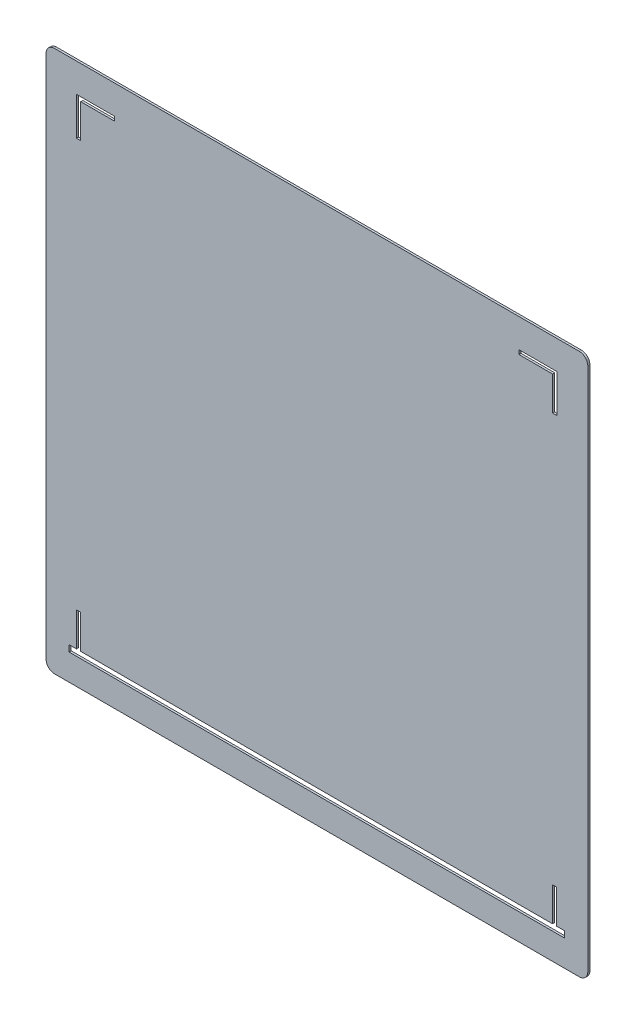
ISO-10303-21;
HEADER;
FILE_DESCRIPTION(('STEP AP214'),'2;1');
FILE_NAME('part.step','',(''),(''),'','','');
FILE_SCHEMA(('AUTOMOTIVE_DESIGN { 1 0 10303 214 1 1 1 1 }'));
ENDSEC;
DATA;
#1=APPLICATION_CONTEXT('core data for automotive mechanical design processes');
#2=APPLICATION_PROTOCOL_DEFINITION('international standard','automotive_design',2000,#1);
#3=PRODUCT_CONTEXT('',#1,'mechanical');
#4=PRODUCT('Part','Part','',(#3));
#5=PRODUCT_RELATED_PRODUCT_CATEGORY('part','',(#4));
#6=PRODUCT_DEFINITION_FORMATION('','',#4);
#7=PRODUCT_DEFINITION_CONTEXT('part definition',#1,'design');
#8=PRODUCT_DEFINITION('design','',#6,#7);
#9=PRODUCT_DEFINITION_SHAPE('','',#8);
#10=(LENGTH_UNIT() NAMED_UNIT(*) SI_UNIT(.MILLI.,.METRE.));
#11=(NAMED_UNIT(*) PLANE_ANGLE_UNIT() SI_UNIT($,.RADIAN.));
#12=(NAMED_UNIT(*) SI_UNIT($,.STERADIAN.) SOLID_ANGLE_UNIT());
#13=UNCERTAINTY_MEASURE_WITH_UNIT(LENGTH_MEASURE(1.E-05),#10,'distance_accuracy_value','');
#14=(GEOMETRIC_REPRESENTATION_CONTEXT(3) GLOBAL_UNCERTAINTY_ASSIGNED_CONTEXT((#13)) GLOBAL_UNIT_ASSIGNED_CONTEXT((#10,
#11,#12)) REPRESENTATION_CONTEXT('',''));
#15=CARTESIAN_POINT('',(0.,0.,0.));
#16=DIRECTION('',(0.,0.,1.));
#17=DIRECTION('',(1.,0.,0.));
#18=AXIS2_PLACEMENT_3D('',#15,#16,#17);
#19=CARTESIAN_POINT('',(150.192053210497,421.056494823786,0.79375));
#20=DIRECTION('',(0.,0.,-1.));
#21=DIRECTION('',(-1.,0.,0.));
#22=AXIS2_PLACEMENT_3D('',#19,#20,#21);
#23=PLANE('',#22);
#24=DIRECTION('',(-1.,0.,0.));
#25=VECTOR('',#24,1.);
#26=CARTESIAN_POINT('',(324.375519551394,413.448773364332,0.79375));
#27=LINE('',#26,#25);
#28=CARTESIAN_POINT('',(338.615258336565,413.448773364332,0.79375));
#29=VERTEX_POINT('',#28);
#30=CARTESIAN_POINT('',(324.375519551394,413.448773364332,0.79375));
#31=VERTEX_POINT('',#30);
#32=EDGE_CURVE('E335',#29,#31,#27,.T.);
#33=ORIENTED_EDGE('',*,*,#32,.F.);
#34=DIRECTION('',(0.,1.,0.));
#35=VECTOR('',#34,1.);
#36=CARTESIAN_POINT('',(338.615258336565,413.448773364332,0.79375));
#37=LINE('',#36,#35);
#38=CARTESIAN_POINT('',(338.615258336565,399.161273364332,0.79375));
#39=VERTEX_POINT('',#38);
#40=EDGE_CURVE('E347',#39,#29,#37,.T.);
#41=ORIENTED_EDGE('',*,*,#40,.F.);
#42=DIRECTION('',(1.,0.,0.));
#43=VECTOR('',#42,1.);
#44=CARTESIAN_POINT('',(338.615258336565,399.161273364332,0.79375));
#45=LINE('',#44,#43);
#46=CARTESIAN_POINT('',(337.027758336565,399.161273364332,0.79375));
#47=VERTEX_POINT('',#46);
#48=EDGE_CURVE('E344',#47,#39,#45,.T.);
#49=ORIENTED_EDGE('',*,*,#48,.F.);
#50=DIRECTION('',(0.,-1.,0.));
#51=VECTOR('',#50,1.);
#52=CARTESIAN_POINT('',(337.027758336565,399.161273364332,0.79375));
#53=LINE('',#52,#51);
#54=CARTESIAN_POINT('',(337.027758336565,411.861273364332,0.79375));
#55=VERTEX_POINT('',#54);
#56=EDGE_CURVE('E342',#55,#47,#53,.T.);
#57=ORIENTED_EDGE('',*,*,#56,.F.);
#58=DIRECTION('',(1.,0.,0.));
#59=VECTOR('',#58,1.);
#60=CARTESIAN_POINT('',(337.027758336565,411.861273364332,0.79375));
#61=LINE('',#60,#59);
#62=CARTESIAN_POINT('',(324.375519551394,411.861273364332,0.79375));
#63=VERTEX_POINT('',#62);
#64=EDGE_CURVE('E340',#63,#55,#61,.T.);
#65=ORIENTED_EDGE('',*,*,#64,.F.);
#66=DIRECTION('',(0.,-1.,0.));
#67=VECTOR('',#66,1.);
#68=CARTESIAN_POINT('',(324.375519551394,411.861273364332,0.79375));
#69=LINE('',#68,#67);
#70=EDGE_CURVE('E337',#31,#63,#69,.T.);
#71=ORIENTED_EDGE('',*,*,#70,.F.);
#72=EDGE_LOOP('',(#33,#41,#49,#57,#65,#71));
#73=FACE_BOUND('',#72,.T.);
#74=CARTESIAN_POINT('',(150.192053210497,421.056494823786,0.79375));
#75=DIRECTION('',(0.,0.,1.));
#76=DIRECTION('',(-1.,0.,0.));
#77=AXIS2_PLACEMENT_3D('',#74,#75,#76);
#78=CIRCLE('',#77,3.17500000000005);
#79=CARTESIAN_POINT('',(150.192053210497,424.231494823786,0.79375));
#80=VERTEX_POINT('',#79);
#81=CARTESIAN_POINT('',(147.017053210497,421.056494823786,0.79375));
#82=VERTEX_POINT('',#81);
#83=EDGE_CURVE('E425',#80,#82,#78,.T.);
#84=ORIENTED_EDGE('',*,*,#83,.T.);
#85=DIRECTION('',(0.,-1.,0.));
#86=VECTOR('',#85,1.);
#87=CARTESIAN_POINT('',(147.017053210497,224.206494823786,0.79375));
#88=LINE('',#87,#86);
#89=CARTESIAN_POINT('',(147.017053210497,224.206494823786,0.79375));
#90=VERTEX_POINT('',#89);
#91=EDGE_CURVE('E428',#82,#90,#88,.T.);
#92=ORIENTED_EDGE('',*,*,#91,.T.);
#93=CARTESIAN_POINT('',(150.192053210497,224.206494823786,0.79375));
#94=DIRECTION('',(0.,0.,1.));
#95=DIRECTION('',(-1.,0.,0.));
#96=AXIS2_PLACEMENT_3D('',#93,#94,#95);
#97=CIRCLE('',#96,3.17500000000005);
#98=CARTESIAN_POINT('',(150.192053210497,221.031494823786,0.79375));
#99=VERTEX_POINT('',#98);
#100=EDGE_CURVE('E431',#90,#99,#97,.T.);
#101=ORIENTED_EDGE('',*,*,#100,.T.);
#102=DIRECTION('',(1.,0.,0.));
#103=VECTOR('',#102,1.);
#104=CARTESIAN_POINT('',(347.042053210497,221.031494823786,0.79375));
#105=LINE('',#104,#103);
#106=CARTESIAN_POINT('',(347.042053210497,221.031494823786,0.79375));
#107=VERTEX_POINT('',#106);
#108=EDGE_CURVE('E433',#99,#107,#105,.T.);
#109=ORIENTED_EDGE('',*,*,#108,.T.);
#110=CARTESIAN_POINT('',(347.042053210497,224.206494823786,0.79375));
#111=DIRECTION('',(0.,0.,1.));
#112=DIRECTION('',(-1.,0.,0.));
#113=AXIS2_PLACEMENT_3D('',#110,#111,#112);
#114=CIRCLE('',#113,3.17500000000001);
#115=CARTESIAN_POINT('',(350.217053210497,224.206494823786,0.79375));
#116=VERTEX_POINT('',#115);
#117=EDGE_CURVE('E435',#107,#116,#114,.T.);
#118=ORIENTED_EDGE('',*,*,#117,.T.);
#119=DIRECTION('',(0.,1.,0.));
#120=VECTOR('',#119,1.);
#121=CARTESIAN_POINT('',(350.217053210497,421.056494823786,0.79375));
#122=LINE('',#121,#120);
#123=CARTESIAN_POINT('',(350.217053210497,421.056494823786,0.79375));
#124=VERTEX_POINT('',#123);
#125=EDGE_CURVE('E437',#116,#124,#122,.T.);
#126=ORIENTED_EDGE('',*,*,#125,.T.);
#127=CARTESIAN_POINT('',(347.042053210497,421.056494823786,0.79375));
#128=DIRECTION('',(0.,0.,1.));
#129=DIRECTION('',(1.,0.,0.));
#130=AXIS2_PLACEMENT_3D('',#127,#128,#129);
#131=CIRCLE('',#130,3.17500000000004);
#132=CARTESIAN_POINT('',(347.042053210497,424.231494823786,0.79375));
#133=VERTEX_POINT('',#132);
#134=EDGE_CURVE('E439',#124,#133,#131,.T.);
#135=ORIENTED_EDGE('',*,*,#134,.T.);
#136=DIRECTION('',(-1.,0.,0.));
#137=VECTOR('',#136,1.);
#138=CARTESIAN_POINT('',(150.192053210497,424.231494823786,0.79375));
#139=LINE('',#138,#137);
#140=EDGE_CURVE('E441',#133,#80,#139,.T.);
#141=ORIENTED_EDGE('',*,*,#140,.T.);
#142=EDGE_LOOP('',(#84,#92,#101,#109,#118,#126,#135,#141));
#143=FACE_BOUND('',#142,.T.);
#144=DIRECTION('',(0.,-1.,0.));
#145=VECTOR('',#144,1.);
#146=CARTESIAN_POINT('',(158.423699589632,399.134562234536,0.79375));
#147=LINE('',#146,#145);
#148=CARTESIAN_POINT('',(158.423699589632,413.422062234536,0.79375));
#149=VERTEX_POINT('',#148);
#150=CARTESIAN_POINT('',(158.423699589632,399.134562234536,0.79375));
#151=VERTEX_POINT('',#150);
#152=EDGE_CURVE('E380',#149,#151,#147,.T.);
#153=ORIENTED_EDGE('',*,*,#152,.F.);
#154=DIRECTION('',(-1.,0.,0.));
#155=VECTOR('',#154,1.);
#156=CARTESIAN_POINT('',(158.423699589632,413.422062234536,0.79375));
#157=LINE('',#156,#155);
#158=CARTESIAN_POINT('',(172.711199589632,413.422062234536,0.79375));
#159=VERTEX_POINT('',#158);
#160=EDGE_CURVE('E392',#159,#149,#157,.T.);
#161=ORIENTED_EDGE('',*,*,#160,.F.);
#162=DIRECTION('',(0.,1.,0.));
#163=VECTOR('',#162,1.);
#164=CARTESIAN_POINT('',(172.711199589632,413.422062234536,0.79375));
#165=LINE('',#164,#163);
#166=CARTESIAN_POINT('',(172.711199589632,411.834562234536,0.79375));
#167=VERTEX_POINT('',#166);
#168=EDGE_CURVE('E389',#167,#159,#165,.T.);
#169=ORIENTED_EDGE('',*,*,#168,.F.);
#170=DIRECTION('',(1.,0.,0.));
#171=VECTOR('',#170,1.);
#172=CARTESIAN_POINT('',(172.711199589632,411.834562234536,0.79375));
#173=LINE('',#172,#171);
#174=CARTESIAN_POINT('',(160.011199589632,411.834562234536,0.79375));
#175=VERTEX_POINT('',#174);
#176=EDGE_CURVE('E387',#175,#167,#173,.T.);
#177=ORIENTED_EDGE('',*,*,#176,.F.);
#178=DIRECTION('',(0.,1.,0.));
#179=VECTOR('',#178,1.);
#180=CARTESIAN_POINT('',(160.011199589632,411.834562234536,0.79375));
#181=LINE('',#180,#179);
#182=CARTESIAN_POINT('',(160.011199589632,399.134562234536,0.79375));
#183=VERTEX_POINT('',#182);
#184=EDGE_CURVE('E385',#183,#175,#181,.T.);
#185=ORIENTED_EDGE('',*,*,#184,.F.);
#186=DIRECTION('',(1.,0.,0.));
#187=VECTOR('',#186,1.);
#188=CARTESIAN_POINT('',(160.011199589632,399.134562234536,0.79375));
#189=LINE('',#188,#187);
#190=EDGE_CURVE('E382',#151,#183,#189,.T.);
#191=ORIENTED_EDGE('',*,*,#190,.F.);
#192=EDGE_LOOP('',(#153,#161,#169,#177,#185,#191));
#193=FACE_BOUND('',#192,.T.);
#194=DIRECTION('',(0.,-1.,0.));
#195=VECTOR('',#194,1.);
#196=CARTESIAN_POINT('',(155.637121112344,233.242895704133,0.79375));
#197=LINE('',#196,#195);
#198=CARTESIAN_POINT('',(155.637121112344,233.242895704133,0.79375));
#199=VERTEX_POINT('',#198);
#200=CARTESIAN_POINT('',(155.637121112344,230.861645704133,0.79375));
#201=VERTEX_POINT('',#200);
#202=EDGE_CURVE('E242',#199,#201,#197,.T.);
#203=ORIENTED_EDGE('',*,*,#202,.F.);
#204=DIRECTION('',(-1.,0.,0.));
#205=VECTOR('',#204,1.);
#206=CARTESIAN_POINT('',(158.424273786717,233.242895704133,0.79375));
#207=LINE('',#206,#205);
#208=CARTESIAN_POINT('',(158.424273786717,233.242895704133,0.79375));
#209=VERTEX_POINT('',#208);
#210=EDGE_CURVE('E283',#209,#199,#207,.T.);
#211=ORIENTED_EDGE('',*,*,#210,.F.);
#212=DIRECTION('',(0.,-1.,0.));
#213=VECTOR('',#212,1.);
#214=CARTESIAN_POINT('',(158.424273786717,245.942895704133,0.79375));
#215=LINE('',#214,#213);
#216=CARTESIAN_POINT('',(158.424273786717,245.942895704133,0.79375));
#217=VERTEX_POINT('',#216);
#218=EDGE_CURVE('E281',#217,#209,#215,.T.);
#219=ORIENTED_EDGE('',*,*,#218,.F.);
#220=DIRECTION('',(-1.,0.,0.));
#221=VECTOR('',#220,1.);
#222=CARTESIAN_POINT('',(158.424273786717,245.942895704133,0.79375));
#223=LINE('',#222,#221);
#224=CARTESIAN_POINT('',(160.011773786717,245.942895704133,0.79375));
#225=VERTEX_POINT('',#224);
#226=EDGE_CURVE('E279',#225,#217,#223,.T.);
#227=ORIENTED_EDGE('',*,*,#226,.F.);
#228=DIRECTION('',(0.,1.,0.));
#229=VECTOR('',#228,1.);
#230=CARTESIAN_POINT('',(160.011773786717,245.942895704133,0.79375));
#231=LINE('',#230,#229);
#232=CARTESIAN_POINT('',(160.011773786717,233.242895704133,0.79375));
#233=VERTEX_POINT('',#232);
#234=EDGE_CURVE('E277',#233,#225,#231,.T.);
#235=ORIENTED_EDGE('',*,*,#234,.F.);
#236=DIRECTION('',(-0.99999999570574,9.26742606114764E-05,0.));
#237=VECTOR('',#236,1.);
#238=CARTESIAN_POINT('',(160.011773786717,233.242895704133,0.79375));
#239=LINE('',#238,#237);
#240=CARTESIAN_POINT('',(336.970192894217,233.226496213413,0.79375));
#241=VERTEX_POINT('',#240);
#242=EDGE_CURVE('E275',#241,#233,#239,.T.);
#243=ORIENTED_EDGE('',*,*,#242,.F.);
#244=DIRECTION('',(0.,-1.,0.));
#245=VECTOR('',#244,1.);
#246=CARTESIAN_POINT('',(336.970192894217,233.226496213413,0.79375));
#247=LINE('',#246,#245);
#248=CARTESIAN_POINT('',(336.970192894217,245.926496213413,0.79375));
#249=VERTEX_POINT('',#248);
#250=EDGE_CURVE('E273',#249,#241,#247,.T.);
#251=ORIENTED_EDGE('',*,*,#250,.F.);
#252=DIRECTION('',(-1.,0.,0.));
#253=VECTOR('',#252,1.);
#254=CARTESIAN_POINT('',(336.970192894217,245.926496213413,0.79375));
#255=LINE('',#254,#253);
#256=CARTESIAN_POINT('',(338.557692894219,245.926496213413,0.79375));
#257=VERTEX_POINT('',#256);
#258=EDGE_CURVE('E271',#257,#249,#255,.T.);
#259=ORIENTED_EDGE('',*,*,#258,.F.);
#260=DIRECTION('',(0.,1.,0.));
#261=VECTOR('',#260,1.);
#262=CARTESIAN_POINT('',(338.557692894219,245.926496213413,0.79375));
#263=LINE('',#262,#261);
#264=CARTESIAN_POINT('',(338.557692894219,233.226496213413,0.79375));
#265=VERTEX_POINT('',#264);
#266=EDGE_CURVE('E269',#265,#257,#263,.T.);
#267=ORIENTED_EDGE('',*,*,#266,.F.);
#268=DIRECTION('',(-1.,0.,0.));
#269=VECTOR('',#268,1.);
#270=CARTESIAN_POINT('',(338.557692894219,233.226496213413,0.79375));
#271=LINE('',#270,#269);
#272=CARTESIAN_POINT('',(341.411037675023,233.226496213413,0.79375));
#273=VERTEX_POINT('',#272);
#274=EDGE_CURVE('E265',#273,#265,#271,.T.);
#275=ORIENTED_EDGE('',*,*,#274,.F.);
#276=DIRECTION('',(0.,1.,0.));
#277=VECTOR('',#276,1.);
#278=CARTESIAN_POINT('',(341.411037675023,233.226496213413,0.79375));
#279=LINE('',#278,#277);
#280=CARTESIAN_POINT('',(341.411037675023,230.861645704133,0.79375));
#281=VERTEX_POINT('',#280);
#282=EDGE_CURVE('E263',#281,#273,#279,.T.);
#283=ORIENTED_EDGE('',*,*,#282,.F.);
#284=DIRECTION('',(1.,0.,0.));
#285=VECTOR('',#284,1.);
#286=CARTESIAN_POINT('',(155.637121112344,230.861645704133,0.79375));
#287=LINE('',#286,#285);
#288=EDGE_CURVE('E250',#201,#281,#287,.T.);
#289=ORIENTED_EDGE('',*,*,#288,.F.);
#290=EDGE_LOOP('',(#203,#211,#219,#227,#235,#243,#251,#259,#267,#275,#283,#289));
#291=FACE_BOUND('',#290,.T.);
#292=ADVANCED_FACE('F33',(#73,#143,#193,#291),#23,.F.);
#293=CARTESIAN_POINT('',(150.192053210497,421.056494823786,0.));
#294=DIRECTION('',(0.,0.,-1.));
#295=DIRECTION('',(-1.,0.,0.));
#296=AXIS2_PLACEMENT_3D('',#293,#294,#295);
#297=PLANE('',#296);
#298=DIRECTION('',(0.,1.,0.));
#299=VECTOR('',#298,1.);
#300=CARTESIAN_POINT('',(338.615258336565,413.448773364332,0.));
#301=LINE('',#300,#299);
#302=CARTESIAN_POINT('',(338.615258336565,399.161273364332,0.));
#303=VERTEX_POINT('',#302);
#304=CARTESIAN_POINT('',(338.615258336565,413.448773364332,0.));
#305=VERTEX_POINT('',#304);
#306=EDGE_CURVE('E338',#303,#305,#301,.T.);
#307=ORIENTED_EDGE('',*,*,#306,.T.);
#308=DIRECTION('',(-1.,0.,0.));
#309=VECTOR('',#308,1.);
#310=CARTESIAN_POINT('',(324.375519551394,413.448773364332,0.));
#311=LINE('',#310,#309);
#312=CARTESIAN_POINT('',(324.375519551394,413.448773364332,0.));
#313=VERTEX_POINT('',#312);
#314=EDGE_CURVE('E258',#305,#313,#311,.T.);
#315=ORIENTED_EDGE('',*,*,#314,.T.);
#316=DIRECTION('',(0.,-1.,0.));
#317=VECTOR('',#316,1.);
#318=CARTESIAN_POINT('',(324.375519551394,411.861273364332,0.));
#319=LINE('',#318,#317);
#320=CARTESIAN_POINT('',(324.375519551394,411.861273364332,0.));
#321=VERTEX_POINT('',#320);
#322=EDGE_CURVE('E352',#313,#321,#319,.T.);
#323=ORIENTED_EDGE('',*,*,#322,.T.);
#324=DIRECTION('',(1.,0.,0.));
#325=VECTOR('',#324,1.);
#326=CARTESIAN_POINT('',(337.027758336565,411.861273364332,0.));
#327=LINE('',#326,#325);
#328=CARTESIAN_POINT('',(337.027758336565,411.861273364332,0.));
#329=VERTEX_POINT('',#328);
#330=EDGE_CURVE('E355',#321,#329,#327,.T.);
#331=ORIENTED_EDGE('',*,*,#330,.T.);
#332=DIRECTION('',(0.,-1.,0.));
#333=VECTOR('',#332,1.);
#334=CARTESIAN_POINT('',(337.027758336565,399.161273364332,0.));
#335=LINE('',#334,#333);
#336=CARTESIAN_POINT('',(337.027758336565,399.161273364332,0.));
#337=VERTEX_POINT('',#336);
#338=EDGE_CURVE('E358',#329,#337,#335,.T.);
#339=ORIENTED_EDGE('',*,*,#338,.T.);
#340=DIRECTION('',(1.,0.,0.));
#341=VECTOR('',#340,1.);
#342=CARTESIAN_POINT('',(338.615258336565,399.161273364332,0.));
#343=LINE('',#342,#341);
#344=EDGE_CURVE('E361',#337,#303,#343,.T.);
#345=ORIENTED_EDGE('',*,*,#344,.T.);
#346=EDGE_LOOP('',(#307,#315,#323,#331,#339,#345));
#347=FACE_BOUND('',#346,.T.);
#348=CARTESIAN_POINT('',(150.192053210497,421.056494823786,0.));
#349=DIRECTION('',(0.,0.,1.));
#350=DIRECTION('',(-1.,0.,0.));
#351=AXIS2_PLACEMENT_3D('',#348,#349,#350);
#352=CIRCLE('',#351,3.17500000000005);
#353=CARTESIAN_POINT('',(150.192053210497,424.231494823786,0.));
#354=VERTEX_POINT('',#353);
#355=CARTESIAN_POINT('',(147.017053210497,421.056494823786,0.));
#356=VERTEX_POINT('',#355);
#357=EDGE_CURVE('E424',#354,#356,#352,.T.);
#358=ORIENTED_EDGE('',*,*,#357,.F.);
#359=DIRECTION('',(-1.,0.,0.));
#360=VECTOR('',#359,1.);
#361=CARTESIAN_POINT('',(150.192053210497,424.231494823786,0.));
#362=LINE('',#361,#360);
#363=CARTESIAN_POINT('',(347.042053210497,424.231494823786,0.));
#364=VERTEX_POINT('',#363);
#365=EDGE_CURVE('E429',#364,#354,#362,.T.);
#366=ORIENTED_EDGE('',*,*,#365,.F.);
#367=CARTESIAN_POINT('',(347.042053210497,421.056494823786,0.));
#368=DIRECTION('',(0.,0.,1.));
#369=DIRECTION('',(1.,0.,0.));
#370=AXIS2_PLACEMENT_3D('',#367,#368,#369);
#371=CIRCLE('',#370,3.17500000000004);
#372=CARTESIAN_POINT('',(350.217053210497,421.056494823786,0.));
#373=VERTEX_POINT('',#372);
#374=EDGE_CURVE('E456',#373,#364,#371,.T.);
#375=ORIENTED_EDGE('',*,*,#374,.F.);
#376=DIRECTION('',(0.,1.,0.));
#377=VECTOR('',#376,1.);
#378=CARTESIAN_POINT('',(350.217053210497,421.056494823786,0.));
#379=LINE('',#378,#377);
#380=CARTESIAN_POINT('',(350.217053210497,224.206494823786,0.));
#381=VERTEX_POINT('',#380);
#382=EDGE_CURVE('E454',#381,#373,#379,.T.);
#383=ORIENTED_EDGE('',*,*,#382,.F.);
#384=CARTESIAN_POINT('',(347.042053210497,224.206494823786,0.));
#385=DIRECTION('',(0.,0.,1.));
#386=DIRECTION('',(-1.,0.,0.));
#387=AXIS2_PLACEMENT_3D('',#384,#385,#386);
#388=CIRCLE('',#387,3.17500000000001);
#389=CARTESIAN_POINT('',(347.042053210497,221.031494823786,0.));
#390=VERTEX_POINT('',#389);
#391=EDGE_CURVE('E452',#390,#381,#388,.T.);
#392=ORIENTED_EDGE('',*,*,#391,.F.);
#393=DIRECTION('',(1.,0.,0.));
#394=VECTOR('',#393,1.);
#395=CARTESIAN_POINT('',(347.042053210497,221.031494823786,0.));
#396=LINE('',#395,#394);
#397=CARTESIAN_POINT('',(150.192053210497,221.031494823786,0.));
#398=VERTEX_POINT('',#397);
#399=EDGE_CURVE('E450',#398,#390,#396,.T.);
#400=ORIENTED_EDGE('',*,*,#399,.F.);
#401=CARTESIAN_POINT('',(150.192053210497,224.206494823786,0.));
#402=DIRECTION('',(0.,0.,1.));
#403=DIRECTION('',(-1.,0.,0.));
#404=AXIS2_PLACEMENT_3D('',#401,#402,#403);
#405=CIRCLE('',#404,3.17500000000005);
#406=CARTESIAN_POINT('',(147.017053210497,224.206494823786,0.));
#407=VERTEX_POINT('',#406);
#408=EDGE_CURVE('E448',#407,#398,#405,.T.);
#409=ORIENTED_EDGE('',*,*,#408,.F.);
#410=DIRECTION('',(0.,-1.,0.));
#411=VECTOR('',#410,1.);
#412=CARTESIAN_POINT('',(147.017053210497,224.206494823786,0.));
#413=LINE('',#412,#411);
#414=EDGE_CURVE('E446',#356,#407,#413,.T.);
#415=ORIENTED_EDGE('',*,*,#414,.F.);
#416=EDGE_LOOP('',(#358,#366,#375,#383,#392,#400,#409,#415));
#417=FACE_BOUND('',#416,.T.);
#418=DIRECTION('',(-1.,0.,0.));
#419=VECTOR('',#418,1.);
#420=CARTESIAN_POINT('',(158.423699589632,413.422062234536,0.));
#421=LINE('',#420,#419);
#422=CARTESIAN_POINT('',(172.711199589632,413.422062234536,0.));
#423=VERTEX_POINT('',#422);
#424=CARTESIAN_POINT('',(158.423699589632,413.422062234536,0.));
#425=VERTEX_POINT('',#424);
#426=EDGE_CURVE('E383',#423,#425,#421,.T.);
#427=ORIENTED_EDGE('',*,*,#426,.T.);
#428=DIRECTION('',(0.,-1.,0.));
#429=VECTOR('',#428,1.);
#430=CARTESIAN_POINT('',(158.423699589632,399.134562234536,0.));
#431=LINE('',#430,#429);
#432=CARTESIAN_POINT('',(158.423699589632,399.134562234536,0.));
#433=VERTEX_POINT('',#432);
#434=EDGE_CURVE('E379',#425,#433,#431,.T.);
#435=ORIENTED_EDGE('',*,*,#434,.T.);
#436=DIRECTION('',(1.,0.,0.));
#437=VECTOR('',#436,1.);
#438=CARTESIAN_POINT('',(160.011199589632,399.134562234536,0.));
#439=LINE('',#438,#437);
#440=CARTESIAN_POINT('',(160.011199589632,399.134562234536,0.));
#441=VERTEX_POINT('',#440);
#442=EDGE_CURVE('E397',#433,#441,#439,.T.);
#443=ORIENTED_EDGE('',*,*,#442,.T.);
#444=DIRECTION('',(0.,1.,0.));
#445=VECTOR('',#444,1.);
#446=CARTESIAN_POINT('',(160.011199589632,411.834562234536,0.));
#447=LINE('',#446,#445);
#448=CARTESIAN_POINT('',(160.011199589632,411.834562234536,0.));
#449=VERTEX_POINT('',#448);
#450=EDGE_CURVE('E400',#441,#449,#447,.T.);
#451=ORIENTED_EDGE('',*,*,#450,.T.);
#452=DIRECTION('',(1.,0.,0.));
#453=VECTOR('',#452,1.);
#454=CARTESIAN_POINT('',(172.711199589632,411.834562234536,0.));
#455=LINE('',#454,#453);
#456=CARTESIAN_POINT('',(172.711199589632,411.834562234536,0.));
#457=VERTEX_POINT('',#456);
#458=EDGE_CURVE('E403',#449,#457,#455,.T.);
#459=ORIENTED_EDGE('',*,*,#458,.T.);
#460=DIRECTION('',(0.,1.,0.));
#461=VECTOR('',#460,1.);
#462=CARTESIAN_POINT('',(172.711199589632,413.422062234536,0.));
#463=LINE('',#462,#461);
#464=EDGE_CURVE('E406',#457,#423,#463,.T.);
#465=ORIENTED_EDGE('',*,*,#464,.T.);
#466=EDGE_LOOP('',(#427,#435,#443,#451,#459,#465));
#467=FACE_BOUND('',#466,.T.);
#468=DIRECTION('',(-1.,0.,0.));
#469=VECTOR('',#468,1.);
#470=CARTESIAN_POINT('',(158.424273786717,233.242895704133,0.));
#471=LINE('',#470,#469);
#472=CARTESIAN_POINT('',(158.424273786717,233.242895704133,0.));
#473=VERTEX_POINT('',#472);
#474=CARTESIAN_POINT('',(155.637121112344,233.242895704133,0.));
#475=VERTEX_POINT('',#474);
#476=EDGE_CURVE('E251',#473,#475,#471,.T.);
#477=ORIENTED_EDGE('',*,*,#476,.T.);
#478=DIRECTION('',(0.,-1.,0.));
#479=VECTOR('',#478,1.);
#480=CARTESIAN_POINT('',(155.637121112344,233.242895704133,0.));
#481=LINE('',#480,#479);
#482=CARTESIAN_POINT('',(155.637121112344,230.861645704133,0.));
#483=VERTEX_POINT('',#482);
#484=EDGE_CURVE('E56',#475,#483,#481,.T.);
#485=ORIENTED_EDGE('',*,*,#484,.T.);
#486=DIRECTION('',(1.,0.,0.));
#487=VECTOR('',#486,1.);
#488=CARTESIAN_POINT('',(155.637121112344,230.861645704133,0.));
#489=LINE('',#488,#487);
#490=CARTESIAN_POINT('',(341.411037675023,230.861645704133,0.));
#491=VERTEX_POINT('',#490);
#492=EDGE_CURVE('E257',#483,#491,#489,.T.);
#493=ORIENTED_EDGE('',*,*,#492,.T.);
#494=DIRECTION('',(0.,1.,0.));
#495=VECTOR('',#494,1.);
#496=CARTESIAN_POINT('',(341.411037675023,233.226496213413,0.));
#497=LINE('',#496,#495);
#498=CARTESIAN_POINT('',(341.411037675023,233.226496213413,0.));
#499=VERTEX_POINT('',#498);
#500=EDGE_CURVE('E287',#491,#499,#497,.T.);
#501=ORIENTED_EDGE('',*,*,#500,.T.);
#502=DIRECTION('',(-1.,0.,0.));
#503=VECTOR('',#502,1.);
#504=CARTESIAN_POINT('',(338.557692894219,233.226496213413,0.));
#505=LINE('',#504,#503);
#506=CARTESIAN_POINT('',(338.557692894219,233.226496213413,0.));
#507=VERTEX_POINT('',#506);
#508=EDGE_CURVE('E290',#499,#507,#505,.T.);
#509=ORIENTED_EDGE('',*,*,#508,.T.);
#510=DIRECTION('',(0.,1.,0.));
#511=VECTOR('',#510,1.);
#512=CARTESIAN_POINT('',(338.557692894219,245.926496213413,0.));
#513=LINE('',#512,#511);
#514=CARTESIAN_POINT('',(338.557692894219,245.926496213413,0.));
#515=VERTEX_POINT('',#514);
#516=EDGE_CURVE('E293',#507,#515,#513,.T.);
#517=ORIENTED_EDGE('',*,*,#516,.T.);
#518=DIRECTION('',(-1.,0.,0.));
#519=VECTOR('',#518,1.);
#520=CARTESIAN_POINT('',(336.970192894217,245.926496213413,0.));
#521=LINE('',#520,#519);
#522=CARTESIAN_POINT('',(336.970192894217,245.926496213413,0.));
#523=VERTEX_POINT('',#522);
#524=EDGE_CURVE('E296',#515,#523,#521,.T.);
#525=ORIENTED_EDGE('',*,*,#524,.T.);
#526=DIRECTION('',(0.,-1.,0.));
#527=VECTOR('',#526,1.);
#528=CARTESIAN_POINT('',(336.970192894217,233.226496213413,0.));
#529=LINE('',#528,#527);
#530=CARTESIAN_POINT('',(336.970192894217,233.226496213413,0.));
#531=VERTEX_POINT('',#530);
#532=EDGE_CURVE('E299',#523,#531,#529,.T.);
#533=ORIENTED_EDGE('',*,*,#532,.T.);
#534=DIRECTION('',(-0.99999999570574,9.26742606114764E-05,0.));
#535=VECTOR('',#534,1.);
#536=CARTESIAN_POINT('',(160.011773786717,233.242895704133,0.));
#537=LINE('',#536,#535);
#538=CARTESIAN_POINT('',(160.011773786717,233.242895704133,0.));
#539=VERTEX_POINT('',#538);
#540=EDGE_CURVE('E302',#531,#539,#537,.T.);
#541=ORIENTED_EDGE('',*,*,#540,.T.);
#542=DIRECTION('',(0.,1.,0.));
#543=VECTOR('',#542,1.);
#544=CARTESIAN_POINT('',(160.011773786717,245.942895704133,0.));
#545=LINE('',#544,#543);
#546=CARTESIAN_POINT('',(160.011773786717,245.942895704133,0.));
#547=VERTEX_POINT('',#546);
#548=EDGE_CURVE('E305',#539,#547,#545,.T.);
#549=ORIENTED_EDGE('',*,*,#548,.T.);
#550=DIRECTION('',(-1.,0.,0.));
#551=VECTOR('',#550,1.);
#552=CARTESIAN_POINT('',(158.424273786717,245.942895704133,0.));
#553=LINE('',#552,#551);
#554=CARTESIAN_POINT('',(158.424273786717,245.942895704133,0.));
#555=VERTEX_POINT('',#554);
#556=EDGE_CURVE('E308',#547,#555,#553,.T.);
#557=ORIENTED_EDGE('',*,*,#556,.T.);
#558=DIRECTION('',(0.,-1.,0.));
#559=VECTOR('',#558,1.);
#560=CARTESIAN_POINT('',(158.424273786717,245.942895704133,0.));
#561=LINE('',#560,#559);
#562=EDGE_CURVE('E311',#555,#473,#561,.T.);
#563=ORIENTED_EDGE('',*,*,#562,.T.);
#564=EDGE_LOOP('',(#477,#485,#493,#501,#509,#517,#525,#533,#541,#549,#557,#563));
#565=FACE_BOUND('',#564,.T.);
#566=ADVANCED_FACE('F486',(#347,#417,#467,#565),#297,.T.);
#567=CARTESIAN_POINT('',(150.192053210497,421.056494823786,0.79375));
#568=DIRECTION('',(0.,0.,-1.));
#569=DIRECTION('',(-1.,0.,0.));
#570=AXIS2_PLACEMENT_3D('',#567,#568,#569);
#571=CYLINDRICAL_SURFACE('',#570,3.17500000000005);
#572=ORIENTED_EDGE('',*,*,#357,.T.);
#573=DIRECTION('',(0.,0.,-1.));
#574=VECTOR('',#573,1.);
#575=CARTESIAN_POINT('',(147.017053210497,421.056494823786,0.79375));
#576=LINE('',#575,#574);
#577=EDGE_CURVE('E11',#82,#356,#576,.T.);
#578=ORIENTED_EDGE('',*,*,#577,.F.);
#579=ORIENTED_EDGE('',*,*,#83,.F.);
#580=DIRECTION('',(0.,0.,-1.));
#581=VECTOR('',#580,1.);
#582=CARTESIAN_POINT('',(150.192053210497,424.231494823786,0.79375));
#583=LINE('',#582,#581);
#584=EDGE_CURVE('E443',#80,#354,#583,.T.);
#585=ORIENTED_EDGE('',*,*,#584,.T.);
#586=EDGE_LOOP('',(#572,#578,#579,#585));
#587=FACE_BOUND('',#586,.T.);
#588=ADVANCED_FACE('F35',(#587),#571,.T.);
#589=CARTESIAN_POINT('',(147.017053210497,224.206494823786,0.79375));
#590=DIRECTION('',(1.,0.,0.));
#591=DIRECTION('',(0.,0.,-1.));
#592=AXIS2_PLACEMENT_3D('',#589,#590,#591);
#593=PLANE('',#592);
#594=ORIENTED_EDGE('',*,*,#414,.T.);
#595=DIRECTION('',(0.,0.,-1.));
#596=VECTOR('',#595,1.);
#597=CARTESIAN_POINT('',(147.017053210497,224.206494823786,0.79375));
#598=LINE('',#597,#596);
#599=EDGE_CURVE('E41',#90,#407,#598,.T.);
#600=ORIENTED_EDGE('',*,*,#599,.F.);
#601=ORIENTED_EDGE('',*,*,#91,.F.);
#602=ORIENTED_EDGE('',*,*,#577,.T.);
#603=EDGE_LOOP('',(#594,#600,#601,#602));
#604=FACE_BOUND('',#603,.T.);
#605=ADVANCED_FACE('F504',(#604),#593,.F.);
#606=CARTESIAN_POINT('',(150.192053210497,224.206494823786,0.79375));
#607=DIRECTION('',(0.,0.,-1.));
#608=DIRECTION('',(-1.,0.,0.));
#609=AXIS2_PLACEMENT_3D('',#606,#607,#608);
#610=CYLINDRICAL_SURFACE('',#609,3.17500000000005);
#611=ORIENTED_EDGE('',*,*,#408,.T.);
#612=DIRECTION('',(0.,0.,-1.));
#613=VECTOR('',#612,1.);
#614=CARTESIAN_POINT('',(150.192053210497,221.031494823786,0.79375));
#615=LINE('',#614,#613);
#616=EDGE_CURVE('E473',#99,#398,#615,.T.);
#617=ORIENTED_EDGE('',*,*,#616,.F.);
#618=ORIENTED_EDGE('',*,*,#100,.F.);
#619=ORIENTED_EDGE('',*,*,#599,.T.);
#620=EDGE_LOOP('',(#611,#617,#618,#619));
#621=FACE_BOUND('',#620,.T.);
#622=ADVANCED_FACE('F480',(#621),#610,.T.);
#623=CARTESIAN_POINT('',(347.042053210497,221.031494823786,0.79375));
#624=DIRECTION('',(0.,1.,0.));
#625=DIRECTION('',(0.,0.,1.));
#626=AXIS2_PLACEMENT_3D('',#623,#624,#625);
#627=PLANE('',#626);
#628=ORIENTED_EDGE('',*,*,#399,.T.);
#629=DIRECTION('',(0.,0.,-1.));
#630=VECTOR('',#629,1.);
#631=CARTESIAN_POINT('',(347.042053210497,221.031494823786,0.79375));
#632=LINE('',#631,#630);
#633=EDGE_CURVE('E470',#107,#390,#632,.T.);
#634=ORIENTED_EDGE('',*,*,#633,.F.);
#635=ORIENTED_EDGE('',*,*,#108,.F.);
#636=ORIENTED_EDGE('',*,*,#616,.T.);
#637=EDGE_LOOP('',(#628,#634,#635,#636));
#638=FACE_BOUND('',#637,.T.);
#639=ADVANCED_FACE('F492',(#638),#627,.F.);
#640=CARTESIAN_POINT('',(347.042053210497,224.206494823786,0.79375));
#641=DIRECTION('',(0.,0.,-1.));
#642=DIRECTION('',(-1.,0.,0.));
#643=AXIS2_PLACEMENT_3D('',#640,#641,#642);
#644=CYLINDRICAL_SURFACE('',#643,3.17500000000001);
#645=ORIENTED_EDGE('',*,*,#391,.T.);
#646=DIRECTION('',(0.,0.,-1.));
#647=VECTOR('',#646,1.);
#648=CARTESIAN_POINT('',(350.217053210497,224.206494823786,0.79375));
#649=LINE('',#648,#647);
#650=EDGE_CURVE('E467',#116,#381,#649,.T.);
#651=ORIENTED_EDGE('',*,*,#650,.F.);
#652=ORIENTED_EDGE('',*,*,#117,.F.);
#653=ORIENTED_EDGE('',*,*,#633,.T.);
#654=EDGE_LOOP('',(#645,#651,#652,#653));
#655=FACE_BOUND('',#654,.T.);
#656=ADVANCED_FACE('F496',(#655),#644,.T.);
#657=CARTESIAN_POINT('',(350.217053210497,421.056494823786,0.79375));
#658=DIRECTION('',(-1.,0.,0.));
#659=DIRECTION('',(0.,-1.,0.));
#660=AXIS2_PLACEMENT_3D('',#657,#658,#659);
#661=PLANE('',#660);
#662=ORIENTED_EDGE('',*,*,#382,.T.);
#663=DIRECTION('',(0.,0.,-1.));
#664=VECTOR('',#663,1.);
#665=CARTESIAN_POINT('',(350.217053210497,421.056494823786,0.79375));
#666=LINE('',#665,#664);
#667=EDGE_CURVE('E464',#124,#373,#666,.T.);
#668=ORIENTED_EDGE('',*,*,#667,.F.);
#669=ORIENTED_EDGE('',*,*,#125,.F.);
#670=ORIENTED_EDGE('',*,*,#650,.T.);
#671=EDGE_LOOP('',(#662,#668,#669,#670));
#672=FACE_BOUND('',#671,.T.);
#673=ADVANCED_FACE('F517',(#672),#661,.F.);
#674=CARTESIAN_POINT('',(347.042053210497,421.056494823786,0.79375));
#675=DIRECTION('',(0.,0.,-1.));
#676=DIRECTION('',(-1.,0.,0.));
#677=AXIS2_PLACEMENT_3D('',#674,#675,#676);
#678=CYLINDRICAL_SURFACE('',#677,3.17500000000004);
#679=ORIENTED_EDGE('',*,*,#374,.T.);
#680=DIRECTION('',(0.,0.,-1.));
#681=VECTOR('',#680,1.);
#682=CARTESIAN_POINT('',(347.042053210497,424.231494823786,0.79375));
#683=LINE('',#682,#681);
#684=EDGE_CURVE('E461',#133,#364,#683,.T.);
#685=ORIENTED_EDGE('',*,*,#684,.F.);
#686=ORIENTED_EDGE('',*,*,#134,.F.);
#687=ORIENTED_EDGE('',*,*,#667,.T.);
#688=EDGE_LOOP('',(#679,#685,#686,#687));
#689=FACE_BOUND('',#688,.T.);
#690=ADVANCED_FACE('F515',(#689),#678,.T.);
#691=CARTESIAN_POINT('',(150.192053210497,424.231494823786,0.79375));
#692=DIRECTION('',(0.,-1.,0.));
#693=DIRECTION('',(0.,0.,-1.));
#694=AXIS2_PLACEMENT_3D('',#691,#692,#693);
#695=PLANE('',#694);
#696=ORIENTED_EDGE('',*,*,#365,.T.);
#697=ORIENTED_EDGE('',*,*,#584,.F.);
#698=ORIENTED_EDGE('',*,*,#140,.F.);
#699=ORIENTED_EDGE('',*,*,#684,.T.);
#700=EDGE_LOOP('',(#696,#697,#698,#699));
#701=FACE_BOUND('',#700,.T.);
#702=ADVANCED_FACE('F510',(#701),#695,.F.);
#703=CARTESIAN_POINT('',(158.423699589632,399.134562234536,0.79375));
#704=DIRECTION('',(1.,0.,0.));
#705=DIRECTION('',(0.,0.,-1.));
#706=AXIS2_PLACEMENT_3D('',#703,#704,#705);
#707=PLANE('',#706);
#708=ORIENTED_EDGE('',*,*,#434,.F.);
#709=DIRECTION('',(0.,0.,-1.));
#710=VECTOR('',#709,1.);
#711=CARTESIAN_POINT('',(158.423699589632,413.422062234536,0.79375));
#712=LINE('',#711,#710);
#713=EDGE_CURVE('E394',#149,#425,#712,.T.);
#714=ORIENTED_EDGE('',*,*,#713,.F.);
#715=ORIENTED_EDGE('',*,*,#152,.T.);
#716=DIRECTION('',(0.,0.,-1.));
#717=VECTOR('',#716,1.);
#718=CARTESIAN_POINT('',(158.423699589632,399.134562234536,0.79375));
#719=LINE('',#718,#717);
#720=EDGE_CURVE('E421',#151,#433,#719,.T.);
#721=ORIENTED_EDGE('',*,*,#720,.T.);
#722=EDGE_LOOP('',(#708,#714,#715,#721));
#723=FACE_BOUND('',#722,.T.);
#724=ADVANCED_FACE('F536',(#723),#707,.T.);
#725=CARTESIAN_POINT('',(160.011199589632,399.134562234536,0.79375));
#726=DIRECTION('',(0.,1.,0.));
#727=DIRECTION('',(0.,0.,1.));
#728=AXIS2_PLACEMENT_3D('',#725,#726,#727);
#729=PLANE('',#728);
#730=ORIENTED_EDGE('',*,*,#442,.F.);
#731=ORIENTED_EDGE('',*,*,#720,.F.);
#732=ORIENTED_EDGE('',*,*,#190,.T.);
#733=DIRECTION('',(0.,0.,-1.));
#734=VECTOR('',#733,1.);
#735=CARTESIAN_POINT('',(160.011199589632,399.134562234536,0.79375));
#736=LINE('',#735,#734);
#737=EDGE_CURVE('E419',#183,#441,#736,.T.);
#738=ORIENTED_EDGE('',*,*,#737,.T.);
#739=EDGE_LOOP('',(#730,#731,#732,#738));
#740=FACE_BOUND('',#739,.T.);
#741=ADVANCED_FACE('F543',(#740),#729,.T.);
#742=CARTESIAN_POINT('',(160.011199589632,411.834562234536,0.79375));
#743=DIRECTION('',(-1.,0.,0.));
#744=DIRECTION('',(0.,0.,1.));
#745=AXIS2_PLACEMENT_3D('',#742,#743,#744);
#746=PLANE('',#745);
#747=ORIENTED_EDGE('',*,*,#450,.F.);
#748=ORIENTED_EDGE('',*,*,#737,.F.);
#749=ORIENTED_EDGE('',*,*,#184,.T.);
#750=DIRECTION('',(0.,0.,-1.));
#751=VECTOR('',#750,1.);
#752=CARTESIAN_POINT('',(160.011199589632,411.834562234536,0.79375));
#753=LINE('',#752,#751);
#754=EDGE_CURVE('E417',#175,#449,#753,.T.);
#755=ORIENTED_EDGE('',*,*,#754,.T.);
#756=EDGE_LOOP('',(#747,#748,#749,#755));
#757=FACE_BOUND('',#756,.T.);
#758=ADVANCED_FACE('F548',(#757),#746,.T.);
#759=CARTESIAN_POINT('',(172.711199589632,411.834562234536,0.79375));
#760=DIRECTION('',(0.,1.,0.));
#761=DIRECTION('',(0.,0.,1.));
#762=AXIS2_PLACEMENT_3D('',#759,#760,#761);
#763=PLANE('',#762);
#764=ORIENTED_EDGE('',*,*,#458,.F.);
#765=ORIENTED_EDGE('',*,*,#754,.F.);
#766=ORIENTED_EDGE('',*,*,#176,.T.);
#767=DIRECTION('',(0.,0.,-1.));
#768=VECTOR('',#767,1.);
#769=CARTESIAN_POINT('',(172.711199589632,411.834562234536,0.79375));
#770=LINE('',#769,#768);
#771=EDGE_CURVE('E415',#167,#457,#770,.T.);
#772=ORIENTED_EDGE('',*,*,#771,.T.);
#773=EDGE_LOOP('',(#764,#765,#766,#772));
#774=FACE_BOUND('',#773,.T.);
#775=ADVANCED_FACE('F572',(#774),#763,.T.);
#776=CARTESIAN_POINT('',(172.711199589632,413.422062234536,0.79375));
#777=DIRECTION('',(-1.,0.,0.));
#778=DIRECTION('',(0.,0.,1.));
#779=AXIS2_PLACEMENT_3D('',#776,#777,#778);
#780=PLANE('',#779);
#781=ORIENTED_EDGE('',*,*,#464,.F.);
#782=ORIENTED_EDGE('',*,*,#771,.F.);
#783=ORIENTED_EDGE('',*,*,#168,.T.);
#784=DIRECTION('',(0.,0.,-1.));
#785=VECTOR('',#784,1.);
#786=CARTESIAN_POINT('',(172.711199589632,413.422062234536,0.79375));
#787=LINE('',#786,#785);
#788=EDGE_CURVE('E413',#159,#423,#787,.T.);
#789=ORIENTED_EDGE('',*,*,#788,.T.);
#790=EDGE_LOOP('',(#781,#782,#783,#789));
#791=FACE_BOUND('',#790,.T.);
#792=ADVANCED_FACE('F562',(#791),#780,.T.);
#793=CARTESIAN_POINT('',(158.423699589632,413.422062234536,0.79375));
#794=DIRECTION('',(0.,-1.,0.));
#795=DIRECTION('',(0.,0.,-1.));
#796=AXIS2_PLACEMENT_3D('',#793,#794,#795);
#797=PLANE('',#796);
#798=ORIENTED_EDGE('',*,*,#426,.F.);
#799=ORIENTED_EDGE('',*,*,#788,.F.);
#800=ORIENTED_EDGE('',*,*,#160,.T.);
#801=ORIENTED_EDGE('',*,*,#713,.T.);
#802=EDGE_LOOP('',(#798,#799,#800,#801));
#803=FACE_BOUND('',#802,.T.);
#804=ADVANCED_FACE('F555',(#803),#797,.T.);
#805=CARTESIAN_POINT('',(324.375519551394,413.448773364332,0.79375));
#806=DIRECTION('',(0.,-1.,0.));
#807=DIRECTION('',(0.,0.,-1.));
#808=AXIS2_PLACEMENT_3D('',#805,#806,#807);
#809=PLANE('',#808);
#810=ORIENTED_EDGE('',*,*,#314,.F.);
#811=DIRECTION('',(0.,0.,-1.));
#812=VECTOR('',#811,1.);
#813=CARTESIAN_POINT('',(338.615258336565,413.448773364332,0.79375));
#814=LINE('',#813,#812);
#815=EDGE_CURVE('E349',#29,#305,#814,.T.);
#816=ORIENTED_EDGE('',*,*,#815,.F.);
#817=ORIENTED_EDGE('',*,*,#32,.T.);
#818=DIRECTION('',(0.,0.,-1.));
#819=VECTOR('',#818,1.);
#820=CARTESIAN_POINT('',(324.375519551394,413.448773364332,0.79375));
#821=LINE('',#820,#819);
#822=EDGE_CURVE('E376',#31,#313,#821,.T.);
#823=ORIENTED_EDGE('',*,*,#822,.T.);
#824=EDGE_LOOP('',(#810,#816,#817,#823));
#825=FACE_BOUND('',#824,.T.);
#826=ADVANCED_FACE('F584',(#825),#809,.T.);
#827=CARTESIAN_POINT('',(324.375519551394,411.861273364332,0.79375));
#828=DIRECTION('',(1.,0.,0.));
#829=DIRECTION('',(0.,0.,-1.));
#830=AXIS2_PLACEMENT_3D('',#827,#828,#829);
#831=PLANE('',#830);
#832=ORIENTED_EDGE('',*,*,#322,.F.);
#833=ORIENTED_EDGE('',*,*,#822,.F.);
#834=ORIENTED_EDGE('',*,*,#70,.T.);
#835=DIRECTION('',(0.,0.,-1.));
#836=VECTOR('',#835,1.);
#837=CARTESIAN_POINT('',(324.375519551394,411.861273364332,0.79375));
#838=LINE('',#837,#836);
#839=EDGE_CURVE('E374',#63,#321,#838,.T.);
#840=ORIENTED_EDGE('',*,*,#839,.T.);
#841=EDGE_LOOP('',(#832,#833,#834,#840));
#842=FACE_BOUND('',#841,.T.);
#843=ADVANCED_FACE('F587',(#842),#831,.T.);
#844=CARTESIAN_POINT('',(337.027758336565,411.861273364332,0.79375));
#845=DIRECTION('',(0.,1.,0.));
#846=DIRECTION('',(0.,0.,1.));
#847=AXIS2_PLACEMENT_3D('',#844,#845,#846);
#848=PLANE('',#847);
#849=ORIENTED_EDGE('',*,*,#330,.F.);
#850=ORIENTED_EDGE('',*,*,#839,.F.);
#851=ORIENTED_EDGE('',*,*,#64,.T.);
#852=DIRECTION('',(0.,0.,-1.));
#853=VECTOR('',#852,1.);
#854=CARTESIAN_POINT('',(337.027758336565,411.861273364332,0.79375));
#855=LINE('',#854,#853);
#856=EDGE_CURVE('E372',#55,#329,#855,.T.);
#857=ORIENTED_EDGE('',*,*,#856,.T.);
#858=EDGE_LOOP('',(#849,#850,#851,#857));
#859=FACE_BOUND('',#858,.T.);
#860=ADVANCED_FACE('F591',(#859),#848,.T.);
#861=CARTESIAN_POINT('',(337.027758336565,399.161273364332,0.79375));
#862=DIRECTION('',(1.,0.,0.));
#863=DIRECTION('',(0.,0.,-1.));
#864=AXIS2_PLACEMENT_3D('',#861,#862,#863);
#865=PLANE('',#864);
#866=ORIENTED_EDGE('',*,*,#338,.F.);
#867=ORIENTED_EDGE('',*,*,#856,.F.);
#868=ORIENTED_EDGE('',*,*,#56,.T.);
#869=DIRECTION('',(0.,0.,-1.));
#870=VECTOR('',#869,1.);
#871=CARTESIAN_POINT('',(337.027758336565,399.161273364332,0.79375));
#872=LINE('',#871,#870);
#873=EDGE_CURVE('E370',#47,#337,#872,.T.);
#874=ORIENTED_EDGE('',*,*,#873,.T.);
#875=EDGE_LOOP('',(#866,#867,#868,#874));
#876=FACE_BOUND('',#875,.T.);
#877=ADVANCED_FACE('F595',(#876),#865,.T.);
#878=CARTESIAN_POINT('',(338.615258336565,399.161273364332,0.79375));
#879=DIRECTION('',(0.,1.,0.));
#880=DIRECTION('',(0.,0.,1.));
#881=AXIS2_PLACEMENT_3D('',#878,#879,#880);
#882=PLANE('',#881);
#883=ORIENTED_EDGE('',*,*,#344,.F.);
#884=ORIENTED_EDGE('',*,*,#873,.F.);
#885=ORIENTED_EDGE('',*,*,#48,.T.);
#886=DIRECTION('',(0.,0.,-1.));
#887=VECTOR('',#886,1.);
#888=CARTESIAN_POINT('',(338.615258336565,399.161273364332,0.79375));
#889=LINE('',#888,#887);
#890=EDGE_CURVE('E368',#39,#303,#889,.T.);
#891=ORIENTED_EDGE('',*,*,#890,.T.);
#892=EDGE_LOOP('',(#883,#884,#885,#891));
#893=FACE_BOUND('',#892,.T.);
#894=ADVANCED_FACE('F599',(#893),#882,.T.);
#895=CARTESIAN_POINT('',(338.615258336565,413.448773364332,0.79375));
#896=DIRECTION('',(-1.,0.,0.));
#897=DIRECTION('',(0.,0.,1.));
#898=AXIS2_PLACEMENT_3D('',#895,#896,#897);
#899=PLANE('',#898);
#900=ORIENTED_EDGE('',*,*,#306,.F.);
#901=ORIENTED_EDGE('',*,*,#890,.F.);
#902=ORIENTED_EDGE('',*,*,#40,.T.);
#903=ORIENTED_EDGE('',*,*,#815,.T.);
#904=EDGE_LOOP('',(#900,#901,#902,#903));
#905=FACE_BOUND('',#904,.T.);
#906=ADVANCED_FACE('F603',(#905),#899,.T.);
#907=CARTESIAN_POINT('',(155.637121112344,233.242895704133,0.79375));
#908=DIRECTION('',(1.,0.,0.));
#909=DIRECTION('',(0.,0.,-1.));
#910=AXIS2_PLACEMENT_3D('',#907,#908,#909);
#911=PLANE('',#910);
#912=ORIENTED_EDGE('',*,*,#484,.F.);
#913=DIRECTION('',(0.,0.,-1.));
#914=VECTOR('',#913,1.);
#915=CARTESIAN_POINT('',(155.637121112344,233.242895704133,0.79375));
#916=LINE('',#915,#914);
#917=EDGE_CURVE('E246',#199,#475,#916,.T.);
#918=ORIENTED_EDGE('',*,*,#917,.F.);
#919=ORIENTED_EDGE('',*,*,#202,.T.);
#920=DIRECTION('',(0.,0.,-1.));
#921=VECTOR('',#920,1.);
#922=CARTESIAN_POINT('',(155.637121112344,230.861645704133,0.79375));
#923=LINE('',#922,#921);
#924=EDGE_CURVE('E245',#201,#483,#923,.T.);
#925=ORIENTED_EDGE('',*,*,#924,.T.);
#926=EDGE_LOOP('',(#912,#918,#919,#925));
#927=FACE_BOUND('',#926,.T.);
#928=ADVANCED_FACE('F244',(#927),#911,.T.);
#929=CARTESIAN_POINT('',(155.637121112344,230.861645704133,0.79375));
#930=DIRECTION('',(0.,1.,0.));
#931=DIRECTION('',(0.,0.,1.));
#932=AXIS2_PLACEMENT_3D('',#929,#930,#931);
#933=PLANE('',#932);
#934=ORIENTED_EDGE('',*,*,#492,.F.);
#935=ORIENTED_EDGE('',*,*,#924,.F.);
#936=ORIENTED_EDGE('',*,*,#288,.T.);
#937=DIRECTION('',(0.,0.,-1.));
#938=VECTOR('',#937,1.);
#939=CARTESIAN_POINT('',(341.411037675023,230.861645704133,0.79375));
#940=LINE('',#939,#938);
#941=EDGE_CURVE('E259',#281,#491,#940,.T.);
#942=ORIENTED_EDGE('',*,*,#941,.T.);
#943=EDGE_LOOP('',(#934,#935,#936,#942));
#944=FACE_BOUND('',#943,.T.);
#945=ADVANCED_FACE('F254',(#944),#933,.T.);
#946=CARTESIAN_POINT('',(341.411037675023,233.226496213413,0.79375));
#947=DIRECTION('',(-1.,0.,0.));
#948=DIRECTION('',(0.,0.,1.));
#949=AXIS2_PLACEMENT_3D('',#946,#947,#948);
#950=PLANE('',#949);
#951=ORIENTED_EDGE('',*,*,#500,.F.);
#952=ORIENTED_EDGE('',*,*,#941,.F.);
#953=ORIENTED_EDGE('',*,*,#282,.T.);
#954=DIRECTION('',(0.,0.,-1.));
#955=VECTOR('',#954,1.);
#956=CARTESIAN_POINT('',(341.411037675023,233.226496213413,0.79375));
#957=LINE('',#956,#955);
#958=EDGE_CURVE('E332',#273,#499,#957,.T.);
#959=ORIENTED_EDGE('',*,*,#958,.T.);
#960=EDGE_LOOP('',(#951,#952,#953,#959));
#961=FACE_BOUND('',#960,.T.);
#962=ADVANCED_FACE('F612',(#961),#950,.T.);
#963=CARTESIAN_POINT('',(338.557692894219,233.226496213413,0.79375));
#964=DIRECTION('',(0.,-1.,0.));
#965=DIRECTION('',(0.,0.,-1.));
#966=AXIS2_PLACEMENT_3D('',#963,#964,#965);
#967=PLANE('',#966);
#968=ORIENTED_EDGE('',*,*,#508,.F.);
#969=ORIENTED_EDGE('',*,*,#958,.F.);
#970=ORIENTED_EDGE('',*,*,#274,.T.);
#971=DIRECTION('',(0.,0.,-1.));
#972=VECTOR('',#971,1.);
#973=CARTESIAN_POINT('',(338.557692894219,233.226496213413,0.79375));
#974=LINE('',#973,#972);
#975=EDGE_CURVE('E330',#265,#507,#974,.T.);
#976=ORIENTED_EDGE('',*,*,#975,.T.);
#977=EDGE_LOOP('',(#968,#969,#970,#976));
#978=FACE_BOUND('',#977,.T.);
#979=ADVANCED_FACE('F615',(#978),#967,.T.);
#980=CARTESIAN_POINT('',(338.557692894219,245.926496213413,0.79375));
#981=DIRECTION('',(-1.,0.,0.));
#982=DIRECTION('',(0.,0.,1.));
#983=AXIS2_PLACEMENT_3D('',#980,#981,#982);
#984=PLANE('',#983);
#985=ORIENTED_EDGE('',*,*,#516,.F.);
#986=ORIENTED_EDGE('',*,*,#975,.F.);
#987=ORIENTED_EDGE('',*,*,#266,.T.);
#988=DIRECTION('',(0.,0.,-1.));
#989=VECTOR('',#988,1.);
#990=CARTESIAN_POINT('',(338.557692894219,245.926496213413,0.79375));
#991=LINE('',#990,#989);
#992=EDGE_CURVE('E328',#257,#515,#991,.T.);
#993=ORIENTED_EDGE('',*,*,#992,.T.);
#994=EDGE_LOOP('',(#985,#986,#987,#993));
#995=FACE_BOUND('',#994,.T.);
#996=ADVANCED_FACE('F619',(#995),#984,.T.);
#997=CARTESIAN_POINT('',(336.970192894217,245.926496213413,0.79375));
#998=DIRECTION('',(0.,-1.,0.));
#999=DIRECTION('',(0.,0.,-1.));
#1000=AXIS2_PLACEMENT_3D('',#997,#998,#999);
#1001=PLANE('',#1000);
#1002=ORIENTED_EDGE('',*,*,#524,.F.);
#1003=ORIENTED_EDGE('',*,*,#992,.F.);
#1004=ORIENTED_EDGE('',*,*,#258,.T.);
#1005=DIRECTION('',(0.,0.,-1.));
#1006=VECTOR('',#1005,1.);
#1007=CARTESIAN_POINT('',(336.970192894217,245.926496213413,0.79375));
#1008=LINE('',#1007,#1006);
#1009=EDGE_CURVE('E326',#249,#523,#1008,.T.);
#1010=ORIENTED_EDGE('',*,*,#1009,.T.);
#1011=EDGE_LOOP('',(#1002,#1003,#1004,#1010));
#1012=FACE_BOUND('',#1011,.T.);
#1013=ADVANCED_FACE('F623',(#1012),#1001,.T.);
#1014=CARTESIAN_POINT('',(336.970192894217,233.226496213413,0.79375));
#1015=DIRECTION('',(1.,0.,0.));
#1016=DIRECTION('',(0.,0.,-1.));
#1017=AXIS2_PLACEMENT_3D('',#1014,#1015,#1016);
#1018=PLANE('',#1017);
#1019=ORIENTED_EDGE('',*,*,#532,.F.);
#1020=ORIENTED_EDGE('',*,*,#1009,.F.);
#1021=ORIENTED_EDGE('',*,*,#250,.T.);
#1022=DIRECTION('',(0.,0.,-1.));
#1023=VECTOR('',#1022,1.);
#1024=CARTESIAN_POINT('',(336.970192894217,233.226496213413,0.79375));
#1025=LINE('',#1024,#1023);
#1026=EDGE_CURVE('E324',#241,#531,#1025,.T.);
#1027=ORIENTED_EDGE('',*,*,#1026,.T.);
#1028=EDGE_LOOP('',(#1019,#1020,#1021,#1027));
#1029=FACE_BOUND('',#1028,.T.);
#1030=ADVANCED_FACE('F627',(#1029),#1018,.T.);
#1031=CARTESIAN_POINT('',(160.011773786717,233.242895704133,0.79375));
#1032=DIRECTION('',(-9.26742606114765E-05,-0.999999995705741,0.));
#1033=DIRECTION('',(0.999999995705741,-9.26742606114765E-05,0.));
#1034=AXIS2_PLACEMENT_3D('',#1031,#1032,#1033);
#1035=PLANE('',#1034);
#1036=ORIENTED_EDGE('',*,*,#540,.F.);
#1037=ORIENTED_EDGE('',*,*,#1026,.F.);
#1038=ORIENTED_EDGE('',*,*,#242,.T.);
#1039=DIRECTION('',(0.,0.,-1.));
#1040=VECTOR('',#1039,1.);
#1041=CARTESIAN_POINT('',(160.011773786717,233.242895704133,0.79375));
#1042=LINE('',#1041,#1040);
#1043=EDGE_CURVE('E322',#233,#539,#1042,.T.);
#1044=ORIENTED_EDGE('',*,*,#1043,.T.);
#1045=EDGE_LOOP('',(#1036,#1037,#1038,#1044));
#1046=FACE_BOUND('',#1045,.T.);
#1047=ADVANCED_FACE('F631',(#1046),#1035,.T.);
#1048=CARTESIAN_POINT('',(160.011773786717,245.942895704133,0.79375));
#1049=DIRECTION('',(-1.,0.,0.));
#1050=DIRECTION('',(0.,0.,1.));
#1051=AXIS2_PLACEMENT_3D('',#1048,#1049,#1050);
#1052=PLANE('',#1051);
#1053=ORIENTED_EDGE('',*,*,#548,.F.);
#1054=ORIENTED_EDGE('',*,*,#1043,.F.);
#1055=ORIENTED_EDGE('',*,*,#234,.T.);
#1056=DIRECTION('',(0.,0.,-1.));
#1057=VECTOR('',#1056,1.);
#1058=CARTESIAN_POINT('',(160.011773786717,245.942895704133,0.79375));
#1059=LINE('',#1058,#1057);
#1060=EDGE_CURVE('E320',#225,#547,#1059,.T.);
#1061=ORIENTED_EDGE('',*,*,#1060,.T.);
#1062=EDGE_LOOP('',(#1053,#1054,#1055,#1061));
#1063=FACE_BOUND('',#1062,.T.);
#1064=ADVANCED_FACE('F635',(#1063),#1052,.T.);
#1065=CARTESIAN_POINT('',(158.424273786717,245.942895704133,0.79375));
#1066=DIRECTION('',(0.,-1.,0.));
#1067=DIRECTION('',(0.,0.,-1.));
#1068=AXIS2_PLACEMENT_3D('',#1065,#1066,#1067);
#1069=PLANE('',#1068);
#1070=ORIENTED_EDGE('',*,*,#556,.F.);
#1071=ORIENTED_EDGE('',*,*,#1060,.F.);
#1072=ORIENTED_EDGE('',*,*,#226,.T.);
#1073=DIRECTION('',(0.,0.,-1.));
#1074=VECTOR('',#1073,1.);
#1075=CARTESIAN_POINT('',(158.424273786717,245.942895704133,0.79375));
#1076=LINE('',#1075,#1074);
#1077=EDGE_CURVE('E318',#217,#555,#1076,.T.);
#1078=ORIENTED_EDGE('',*,*,#1077,.T.);
#1079=EDGE_LOOP('',(#1070,#1071,#1072,#1078));
#1080=FACE_BOUND('',#1079,.T.);
#1081=ADVANCED_FACE('F639',(#1080),#1069,.T.);
#1082=CARTESIAN_POINT('',(158.424273786717,245.942895704133,0.79375));
#1083=DIRECTION('',(1.,0.,0.));
#1084=DIRECTION('',(0.,0.,-1.));
#1085=AXIS2_PLACEMENT_3D('',#1082,#1083,#1084);
#1086=PLANE('',#1085);
#1087=ORIENTED_EDGE('',*,*,#562,.F.);
#1088=ORIENTED_EDGE('',*,*,#1077,.F.);
#1089=ORIENTED_EDGE('',*,*,#218,.T.);
#1090=DIRECTION('',(0.,0.,-1.));
#1091=VECTOR('',#1090,1.);
#1092=CARTESIAN_POINT('',(158.424273786717,233.242895704133,0.79375));
#1093=LINE('',#1092,#1091);
#1094=EDGE_CURVE('E48',#209,#473,#1093,.T.);
#1095=ORIENTED_EDGE('',*,*,#1094,.T.);
#1096=EDGE_LOOP('',(#1087,#1088,#1089,#1095));
#1097=FACE_BOUND('',#1096,.T.);
#1098=ADVANCED_FACE('F643',(#1097),#1086,.T.);
#1099=CARTESIAN_POINT('',(158.424273786717,233.242895704133,0.79375));
#1100=DIRECTION('',(0.,-1.,0.));
#1101=DIRECTION('',(0.,0.,-1.));
#1102=AXIS2_PLACEMENT_3D('',#1099,#1100,#1101);
#1103=PLANE('',#1102);
#1104=ORIENTED_EDGE('',*,*,#476,.F.);
#1105=ORIENTED_EDGE('',*,*,#1094,.F.);
#1106=ORIENTED_EDGE('',*,*,#210,.T.);
#1107=ORIENTED_EDGE('',*,*,#917,.T.);
#1108=EDGE_LOOP('',(#1104,#1105,#1106,#1107));
#1109=FACE_BOUND('',#1108,.T.);
#1110=ADVANCED_FACE('F647',(#1109),#1103,.T.);
#1111=CLOSED_SHELL('',(#292,#566,#588,#605,#622,#639,#656,#673,#690,#702,#724,#741,#758,#775,
#792,#804,#826,#843,#860,#877,#894,#906,#928,#945,#962,#979,#996,#1013,#1030,#1047,#1064,#1081,
#1098,#1110));
#1112=MANIFOLD_SOLID_BREP('B2',#1111);
#1113=ADVANCED_BREP_SHAPE_REPRESENTATION('',(#18,#1112),#14);
#1114=SHAPE_DEFINITION_REPRESENTATION(#9,#1113);
ENDSEC;
END-ISO-10303-21;
